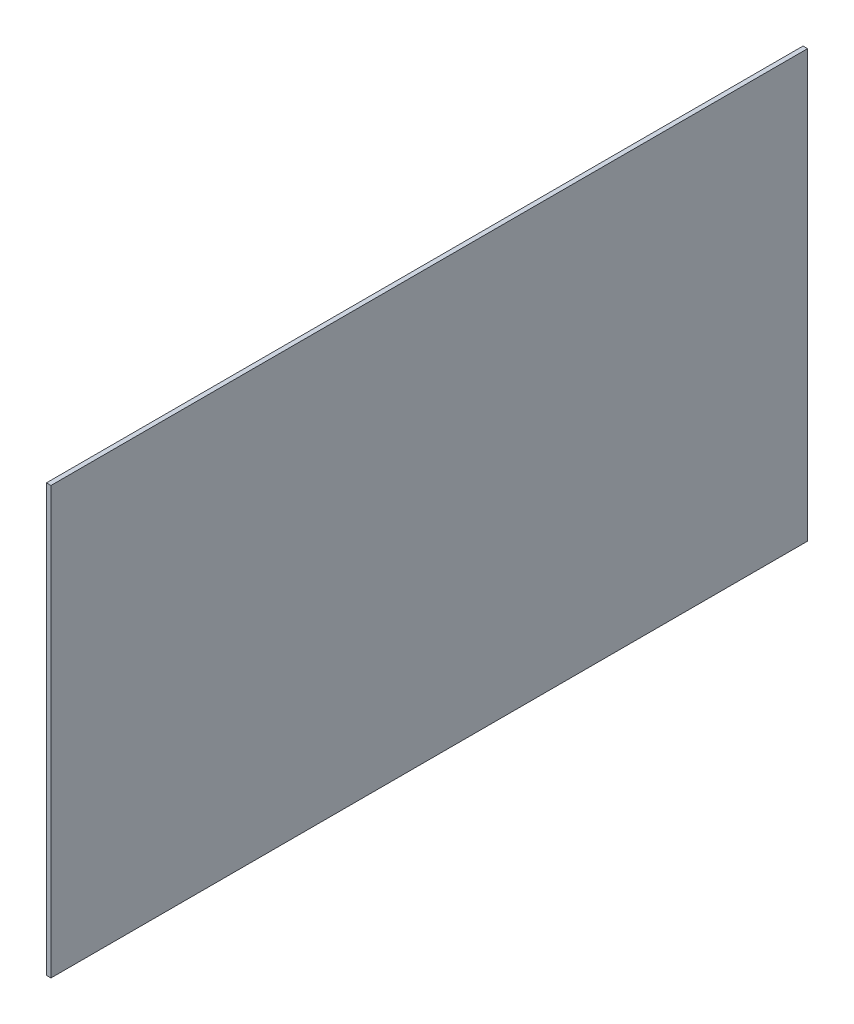
ISO-10303-21;
HEADER;
FILE_DESCRIPTION(('STEP AP214'),'2;1');
FILE_NAME('part.step','',(''),(''),'','','');
FILE_SCHEMA(('AUTOMOTIVE_DESIGN { 1 0 10303 214 1 1 1 1 }'));
ENDSEC;
DATA;
#1=APPLICATION_CONTEXT('core data for automotive mechanical design processes');
#2=APPLICATION_PROTOCOL_DEFINITION('international standard','automotive_design',2000,#1);
#3=PRODUCT_CONTEXT('',#1,'mechanical');
#4=PRODUCT('Part','Part','',(#3));
#5=PRODUCT_RELATED_PRODUCT_CATEGORY('part','',(#4));
#6=PRODUCT_DEFINITION_FORMATION('','',#4);
#7=PRODUCT_DEFINITION_CONTEXT('part definition',#1,'design');
#8=PRODUCT_DEFINITION('design','',#6,#7);
#9=PRODUCT_DEFINITION_SHAPE('','',#8);
#10=(LENGTH_UNIT() NAMED_UNIT(*) SI_UNIT(.MILLI.,.METRE.));
#11=(NAMED_UNIT(*) PLANE_ANGLE_UNIT() SI_UNIT($,.RADIAN.));
#12=(NAMED_UNIT(*) SI_UNIT($,.STERADIAN.) SOLID_ANGLE_UNIT());
#13=UNCERTAINTY_MEASURE_WITH_UNIT(LENGTH_MEASURE(1.E-05),#10,'distance_accuracy_value','');
#14=(GEOMETRIC_REPRESENTATION_CONTEXT(3) GLOBAL_UNCERTAINTY_ASSIGNED_CONTEXT((#13)) GLOBAL_UNIT_ASSIGNED_CONTEXT((#10,
#11,#12)) REPRESENTATION_CONTEXT('',''));
#15=CARTESIAN_POINT('',(0.,0.,0.));
#16=DIRECTION('',(0.,0.,1.));
#17=DIRECTION('',(1.,0.,0.));
#18=AXIS2_PLACEMENT_3D('',#15,#16,#17);
#19=CARTESIAN_POINT('',(3.,140.930435340219,250.));
#20=DIRECTION('',(0.,-1.,0.));
#21=DIRECTION('',(0.,0.,-1.));
#22=AXIS2_PLACEMENT_3D('',#19,#20,#21);
#23=PLANE('',#22);
#24=DIRECTION('',(0.,0.,1.));
#25=VECTOR('',#24,1.);
#26=CARTESIAN_POINT('',(0.,140.930435340219,250.));
#27=LINE('',#26,#25);
#28=CARTESIAN_POINT('',(0.,140.930435340219,-250.));
#29=VERTEX_POINT('',#28);
#30=CARTESIAN_POINT('',(0.,140.930435340219,250.));
#31=VERTEX_POINT('',#30);
#32=EDGE_CURVE('E96',#29,#31,#27,.T.);
#33=ORIENTED_EDGE('',*,*,#32,.T.);
#34=DIRECTION('',(-1.,0.,0.));
#35=VECTOR('',#34,1.);
#36=CARTESIAN_POINT('',(3.,140.930435340219,250.));
#37=LINE('',#36,#35);
#38=CARTESIAN_POINT('',(3.,140.930435340219,250.));
#39=VERTEX_POINT('',#38);
#40=EDGE_CURVE('E11',#39,#31,#37,.T.);
#41=ORIENTED_EDGE('',*,*,#40,.F.);
#42=DIRECTION('',(0.,0.,1.));
#43=VECTOR('',#42,1.);
#44=CARTESIAN_POINT('',(3.,140.930435340219,250.));
#45=LINE('',#44,#43);
#46=CARTESIAN_POINT('',(3.,140.930435340219,-250.));
#47=VERTEX_POINT('',#46);
#48=EDGE_CURVE('E84',#47,#39,#45,.T.);
#49=ORIENTED_EDGE('',*,*,#48,.F.);
#50=DIRECTION('',(-1.,0.,0.));
#51=VECTOR('',#50,1.);
#52=CARTESIAN_POINT('',(3.,140.930435340219,-250.));
#53=LINE('',#52,#51);
#54=EDGE_CURVE('E92',#47,#29,#53,.T.);
#55=ORIENTED_EDGE('',*,*,#54,.T.);
#56=EDGE_LOOP('',(#33,#41,#49,#55));
#57=FACE_BOUND('',#56,.T.);
#58=ADVANCED_FACE('F33',(#57),#23,.F.);
#59=CARTESIAN_POINT('',(3.,140.930435340219,250.));
#60=DIRECTION('',(0.,0.,-1.));
#61=DIRECTION('',(-1.,0.,0.));
#62=AXIS2_PLACEMENT_3D('',#59,#60,#61);
#63=PLANE('',#62);
#64=DIRECTION('',(0.,-1.,0.));
#65=VECTOR('',#64,1.);
#66=CARTESIAN_POINT('',(0.,140.930435340219,250.));
#67=LINE('',#66,#65);
#68=CARTESIAN_POINT('',(0.,-140.930435340219,250.));
#69=VERTEX_POINT('',#68);
#70=EDGE_CURVE('E88',#31,#69,#67,.T.);
#71=ORIENTED_EDGE('',*,*,#70,.T.);
#72=DIRECTION('',(-1.,0.,0.));
#73=VECTOR('',#72,1.);
#74=CARTESIAN_POINT('',(3.,-140.930435340219,250.));
#75=LINE('',#74,#73);
#76=CARTESIAN_POINT('',(3.,-140.930435340219,250.));
#77=VERTEX_POINT('',#76);
#78=EDGE_CURVE('E41',#77,#69,#75,.T.);
#79=ORIENTED_EDGE('',*,*,#78,.F.);
#80=DIRECTION('',(0.,-1.,0.));
#81=VECTOR('',#80,1.);
#82=CARTESIAN_POINT('',(3.,140.930435340219,250.));
#83=LINE('',#82,#81);
#84=EDGE_CURVE('E79',#39,#77,#83,.T.);
#85=ORIENTED_EDGE('',*,*,#84,.F.);
#86=ORIENTED_EDGE('',*,*,#40,.T.);
#87=EDGE_LOOP('',(#71,#79,#85,#86));
#88=FACE_BOUND('',#87,.T.);
#89=ADVANCED_FACE('F87',(#88),#63,.F.);
#90=CARTESIAN_POINT('',(3.,-140.930435340219,250.));
#91=DIRECTION('',(0.,1.,0.));
#92=DIRECTION('',(0.,0.,1.));
#93=AXIS2_PLACEMENT_3D('',#90,#91,#92);
#94=PLANE('',#93);
#95=DIRECTION('',(0.,0.,-1.));
#96=VECTOR('',#95,1.);
#97=CARTESIAN_POINT('',(0.,-140.930435340219,250.));
#98=LINE('',#97,#96);
#99=CARTESIAN_POINT('',(0.,-140.930435340219,-250.));
#100=VERTEX_POINT('',#99);
#101=EDGE_CURVE('E66',#69,#100,#98,.T.);
#102=ORIENTED_EDGE('',*,*,#101,.T.);
#103=DIRECTION('',(-1.,0.,0.));
#104=VECTOR('',#103,1.);
#105=CARTESIAN_POINT('',(3.,-140.930435340219,-250.));
#106=LINE('',#105,#104);
#107=CARTESIAN_POINT('',(3.,-140.930435340219,-250.));
#108=VERTEX_POINT('',#107);
#109=EDGE_CURVE('E89',#108,#100,#106,.T.);
#110=ORIENTED_EDGE('',*,*,#109,.F.);
#111=DIRECTION('',(0.,0.,-1.));
#112=VECTOR('',#111,1.);
#113=CARTESIAN_POINT('',(3.,-140.930435340219,250.));
#114=LINE('',#113,#112);
#115=EDGE_CURVE('E82',#77,#108,#114,.T.);
#116=ORIENTED_EDGE('',*,*,#115,.F.);
#117=ORIENTED_EDGE('',*,*,#78,.T.);
#118=EDGE_LOOP('',(#102,#110,#116,#117));
#119=FACE_BOUND('',#118,.T.);
#120=ADVANCED_FACE('F90',(#119),#94,.F.);
#121=CARTESIAN_POINT('',(3.,-140.930435340219,-250.));
#122=DIRECTION('',(0.,0.,1.));
#123=DIRECTION('',(1.,0.,0.));
#124=AXIS2_PLACEMENT_3D('',#121,#122,#123);
#125=PLANE('',#124);
#126=DIRECTION('',(0.,1.,0.));
#127=VECTOR('',#126,1.);
#128=CARTESIAN_POINT('',(0.,-140.930435340219,-250.));
#129=LINE('',#128,#127);
#130=EDGE_CURVE('E72',#100,#29,#129,.T.);
#131=ORIENTED_EDGE('',*,*,#130,.T.);
#132=ORIENTED_EDGE('',*,*,#54,.F.);
#133=DIRECTION('',(0.,1.,0.));
#134=VECTOR('',#133,1.);
#135=CARTESIAN_POINT('',(3.,-140.930435340219,-250.));
#136=LINE('',#135,#134);
#137=EDGE_CURVE('E49',#108,#47,#136,.T.);
#138=ORIENTED_EDGE('',*,*,#137,.F.);
#139=ORIENTED_EDGE('',*,*,#109,.T.);
#140=EDGE_LOOP('',(#131,#132,#138,#139));
#141=FACE_BOUND('',#140,.T.);
#142=ADVANCED_FACE('F103',(#141),#125,.F.);
#143=CARTESIAN_POINT('',(3.,0.,0.));
#144=DIRECTION('',(1.,0.,0.));
#145=DIRECTION('',(0.,0.,-1.));
#146=AXIS2_PLACEMENT_3D('',#143,#144,#145);
#147=PLANE('',#146);
#148=ORIENTED_EDGE('',*,*,#48,.T.);
#149=ORIENTED_EDGE('',*,*,#84,.T.);
#150=ORIENTED_EDGE('',*,*,#115,.T.);
#151=ORIENTED_EDGE('',*,*,#137,.T.);
#152=EDGE_LOOP('',(#148,#149,#150,#151));
#153=FACE_BOUND('',#152,.T.);
#154=ADVANCED_FACE('F80',(#153),#147,.T.);
#155=CARTESIAN_POINT('',(0.,0.,0.));
#156=DIRECTION('',(1.,0.,0.));
#157=DIRECTION('',(0.,0.,-1.));
#158=AXIS2_PLACEMENT_3D('',#155,#156,#157);
#159=PLANE('',#158);
#160=ORIENTED_EDGE('',*,*,#32,.F.);
#161=ORIENTED_EDGE('',*,*,#130,.F.);
#162=ORIENTED_EDGE('',*,*,#101,.F.);
#163=ORIENTED_EDGE('',*,*,#70,.F.);
#164=EDGE_LOOP('',(#160,#161,#162,#163));
#165=FACE_BOUND('',#164,.T.);
#166=ADVANCED_FACE('F106',(#165),#159,.F.);
#167=CLOSED_SHELL('',(#58,#89,#120,#142,#154,#166));
#168=MANIFOLD_SOLID_BREP('B2',#167);
#169=ADVANCED_BREP_SHAPE_REPRESENTATION('',(#18,#168),#14);
#170=SHAPE_DEFINITION_REPRESENTATION(#9,#169);
ENDSEC;
END-ISO-10303-21;
